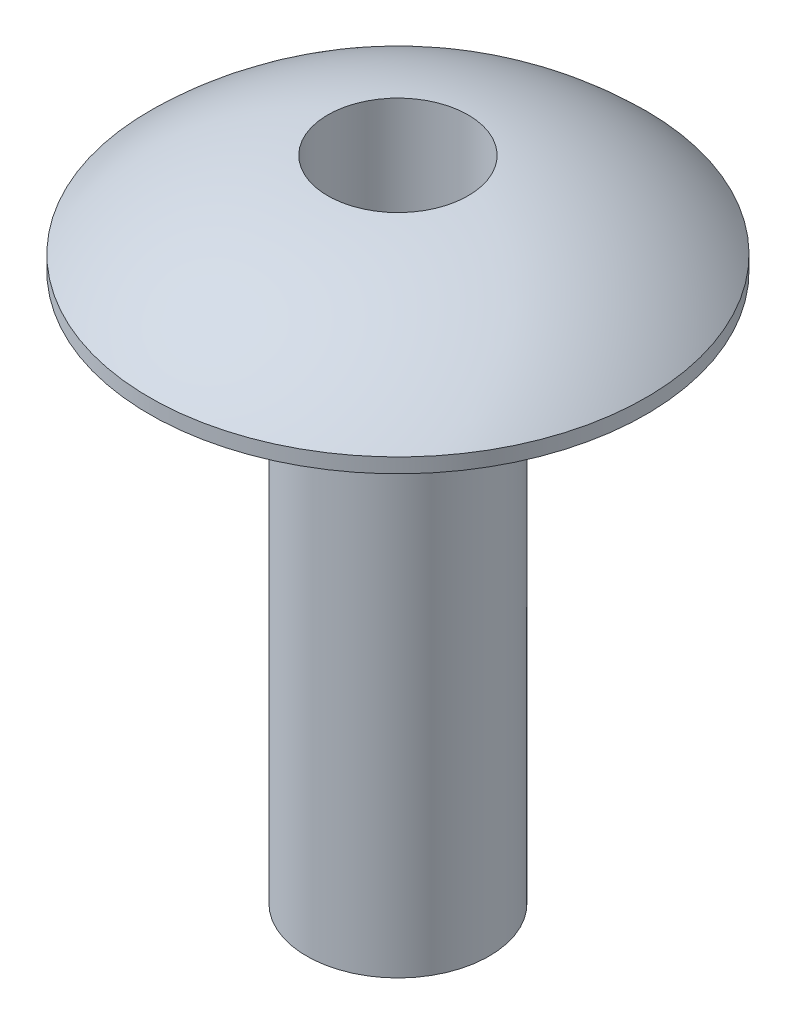
ISO-10303-21;
HEADER;
FILE_DESCRIPTION(('STEP AP214'),'2;1');
FILE_NAME('part.step','',(''),(''),'','','');
FILE_SCHEMA(('AUTOMOTIVE_DESIGN { 1 0 10303 214 1 1 1 1 }'));
ENDSEC;
DATA;
#1=APPLICATION_CONTEXT('core data for automotive mechanical design processes');
#2=APPLICATION_PROTOCOL_DEFINITION('international standard','automotive_design',2000,#1);
#3=PRODUCT_CONTEXT('',#1,'mechanical');
#4=PRODUCT('Part','Part','',(#3));
#5=PRODUCT_RELATED_PRODUCT_CATEGORY('part','',(#4));
#6=PRODUCT_DEFINITION_FORMATION('','',#4);
#7=PRODUCT_DEFINITION_CONTEXT('part definition',#1,'design');
#8=PRODUCT_DEFINITION('design','',#6,#7);
#9=PRODUCT_DEFINITION_SHAPE('','',#8);
#10=(LENGTH_UNIT() NAMED_UNIT(*) SI_UNIT(.MILLI.,.METRE.));
#11=(NAMED_UNIT(*) PLANE_ANGLE_UNIT() SI_UNIT($,.RADIAN.));
#12=(NAMED_UNIT(*) SI_UNIT($,.STERADIAN.) SOLID_ANGLE_UNIT());
#13=UNCERTAINTY_MEASURE_WITH_UNIT(LENGTH_MEASURE(1.E-05),#10,'distance_accuracy_value','');
#14=(GEOMETRIC_REPRESENTATION_CONTEXT(3) GLOBAL_UNCERTAINTY_ASSIGNED_CONTEXT((#13)) GLOBAL_UNIT_ASSIGNED_CONTEXT((#10,
#11,#12)) REPRESENTATION_CONTEXT('',''));
#15=CARTESIAN_POINT('',(0.,0.,0.));
#16=DIRECTION('',(0.,0.,1.));
#17=DIRECTION('',(1.,0.,0.));
#18=AXIS2_PLACEMENT_3D('',#15,#16,#17);
#19=CARTESIAN_POINT('',(0.,11.303,0.));
#20=DIRECTION('',(0.,-1.,0.));
#21=DIRECTION('',(0.,0.,-1.));
#22=AXIS2_PLACEMENT_3D('',#19,#20,#21);
#23=CYLINDRICAL_SURFACE('',#22,1.22019609195085);
#24=CARTESIAN_POINT('',(0.,11.2687527409834,0.));
#25=DIRECTION('',(0.,-1.,0.));
#26=DIRECTION('',(0.,0.,-1.));
#27=AXIS2_PLACEMENT_3D('',#24,#25,#26);
#28=CIRCLE('',#27,1.22019609195085);
#29=CARTESIAN_POINT('',(0.,11.2687527409834,-1.22019609195085));
#30=VERTEX_POINT('',#29);
#31=EDGE_CURVE('E30',#30,#30,#28,.T.);
#32=ORIENTED_EDGE('',*,*,#31,.F.);
#33=EDGE_LOOP('',(#32));
#34=FACE_BOUND('',#33,.T.);
#35=CARTESIAN_POINT('',(0.,0.,0.));
#36=DIRECTION('',(0.,-1.,0.));
#37=DIRECTION('',(0.,0.,-1.));
#38=AXIS2_PLACEMENT_3D('',#35,#36,#37);
#39=CIRCLE('',#38,1.22019609195085);
#40=CARTESIAN_POINT('',(0.,0.,-1.22019609195085));
#41=VERTEX_POINT('',#40);
#42=EDGE_CURVE('E18',#41,#41,#39,.T.);
#43=ORIENTED_EDGE('',*,*,#42,.T.);
#44=EDGE_LOOP('',(#43));
#45=FACE_BOUND('',#44,.T.);
#46=ADVANCED_FACE('F15',(#34,#45),#23,.F.);
#47=CARTESIAN_POINT('',(0.,0.,0.));
#48=DIRECTION('',(0.,1.,0.));
#49=DIRECTION('',(0.,0.,1.));
#50=AXIS2_PLACEMENT_3D('',#47,#48,#49);
#51=PLANE('',#50);
#52=CARTESIAN_POINT('',(0.,0.,0.));
#53=DIRECTION('',(0.,-1.,0.));
#54=DIRECTION('',(0.,0.,-1.));
#55=AXIS2_PLACEMENT_3D('',#52,#53,#54);
#56=CIRCLE('',#55,1.5875);
#57=CARTESIAN_POINT('',(0.,0.,-1.5875));
#58=VERTEX_POINT('',#57);
#59=EDGE_CURVE('E32',#58,#58,#56,.F.);
#60=ORIENTED_EDGE('',*,*,#59,.F.);
#61=EDGE_LOOP('',(#60));
#62=FACE_BOUND('',#61,.T.);
#63=ORIENTED_EDGE('',*,*,#42,.F.);
#64=EDGE_LOOP('',(#63));
#65=FACE_BOUND('',#64,.T.);
#66=ADVANCED_FACE('F45',(#62,#65),#51,.F.);
#67=CARTESIAN_POINT('',(0.,5.97237551201555,-0.580253599790508));
#68=DIRECTION('',(1.,0.,0.));
#69=DIRECTION('',(0.,0.,-1.));
#70=AXIS2_PLACEMENT_3D('',#67,#68,#69);
#71=CIRCLE('',#70,5.33489813818426);
#72=TRIMMED_CURVE('',#71,(PARAMETER_VALUE(-1.67977756346868)),
(PARAMETER_VALUE(1.67977756346868)),.T.,.PARAMETER.);
#73=CARTESIAN_POINT('',(0.,5.97237551201555,0.));
#74=DIRECTION('',(0.,-1.,0.));
#75=AXIS1_PLACEMENT('',#73,#74);
#76=SURFACE_OF_REVOLUTION('',#72,#75);
#77=CARTESIAN_POINT('',(0.,9.779,0.));
#78=DIRECTION('',(0.,-1.,0.));
#79=DIRECTION('',(0.,0.,-1.));
#80=AXIS2_PLACEMENT_3D('',#77,#78,#79);
#81=CIRCLE('',#80,4.318);
#82=CARTESIAN_POINT('',(0.,9.779,-4.318));
#83=VERTEX_POINT('',#82);
#84=EDGE_CURVE('E27',#83,#83,#81,.T.);
#85=ORIENTED_EDGE('',*,*,#84,.F.);
#86=EDGE_LOOP('',(#85));
#87=FACE_BOUND('',#86,.T.);
#88=ORIENTED_EDGE('',*,*,#31,.T.);
#89=EDGE_LOOP('',(#88));
#90=FACE_BOUND('',#89,.T.);
#91=ADVANCED_FACE('F47',(#87,#90),#76,.F.);
#92=CARTESIAN_POINT('',(0.,0.,0.));
#93=DIRECTION('',(0.,-1.,0.));
#94=DIRECTION('',(0.,0.,-1.));
#95=AXIS2_PLACEMENT_3D('',#92,#93,#94);
#96=CYLINDRICAL_SURFACE('',#95,1.5875);
#97=ORIENTED_EDGE('',*,*,#59,.T.);
#98=EDGE_LOOP('',(#97));
#99=FACE_BOUND('',#98,.T.);
#100=CARTESIAN_POINT('',(0.,9.525,0.));
#101=DIRECTION('',(0.,-1.,0.));
#102=DIRECTION('',(0.,0.,-1.));
#103=AXIS2_PLACEMENT_3D('',#100,#101,#102);
#104=CIRCLE('',#103,1.5875);
#105=CARTESIAN_POINT('',(0.,9.525,-1.5875));
#106=VERTEX_POINT('',#105);
#107=EDGE_CURVE('E22',#106,#106,#104,.T.);
#108=ORIENTED_EDGE('',*,*,#107,.T.);
#109=EDGE_LOOP('',(#108));
#110=FACE_BOUND('',#109,.T.);
#111=ADVANCED_FACE('F54',(#99,#110),#96,.T.);
#112=CARTESIAN_POINT('',(0.,0.,0.));
#113=DIRECTION('',(0.,-1.,0.));
#114=DIRECTION('',(0.,0.,-1.));
#115=AXIS2_PLACEMENT_3D('',#112,#113,#114);
#116=CYLINDRICAL_SURFACE('',#115,4.318);
#117=CARTESIAN_POINT('',(0.,9.525,0.));
#118=DIRECTION('',(0.,-1.,0.));
#119=DIRECTION('',(0.,0.,-1.));
#120=AXIS2_PLACEMENT_3D('',#117,#118,#119);
#121=CIRCLE('',#120,4.318);
#122=CARTESIAN_POINT('',(0.,9.525,-4.318));
#123=VERTEX_POINT('',#122);
#124=EDGE_CURVE('E10',#123,#123,#121,.F.);
#125=ORIENTED_EDGE('',*,*,#124,.T.);
#126=EDGE_LOOP('',(#125));
#127=FACE_BOUND('',#126,.T.);
#128=ORIENTED_EDGE('',*,*,#84,.T.);
#129=EDGE_LOOP('',(#128));
#130=FACE_BOUND('',#129,.T.);
#131=ADVANCED_FACE('F60',(#127,#130),#116,.T.);
#132=CARTESIAN_POINT('',(-1.5875,9.525,0.));
#133=DIRECTION('',(0.,1.,0.));
#134=DIRECTION('',(0.,0.,1.));
#135=AXIS2_PLACEMENT_3D('',#132,#133,#134);
#136=PLANE('',#135);
#137=ORIENTED_EDGE('',*,*,#124,.F.);
#138=EDGE_LOOP('',(#137));
#139=FACE_BOUND('',#138,.T.);
#140=ORIENTED_EDGE('',*,*,#107,.F.);
#141=EDGE_LOOP('',(#140));
#142=FACE_BOUND('',#141,.T.);
#143=ADVANCED_FACE('F58',(#139,#142),#136,.F.);
#144=CLOSED_SHELL('',(#46,#66,#91,#111,#131,#143));
#145=MANIFOLD_SOLID_BREP('B1',#144);
#146=ADVANCED_BREP_SHAPE_REPRESENTATION('',(#18,#145),#14);
#147=SHAPE_DEFINITION_REPRESENTATION(#9,#146);
ENDSEC;
END-ISO-10303-21;
